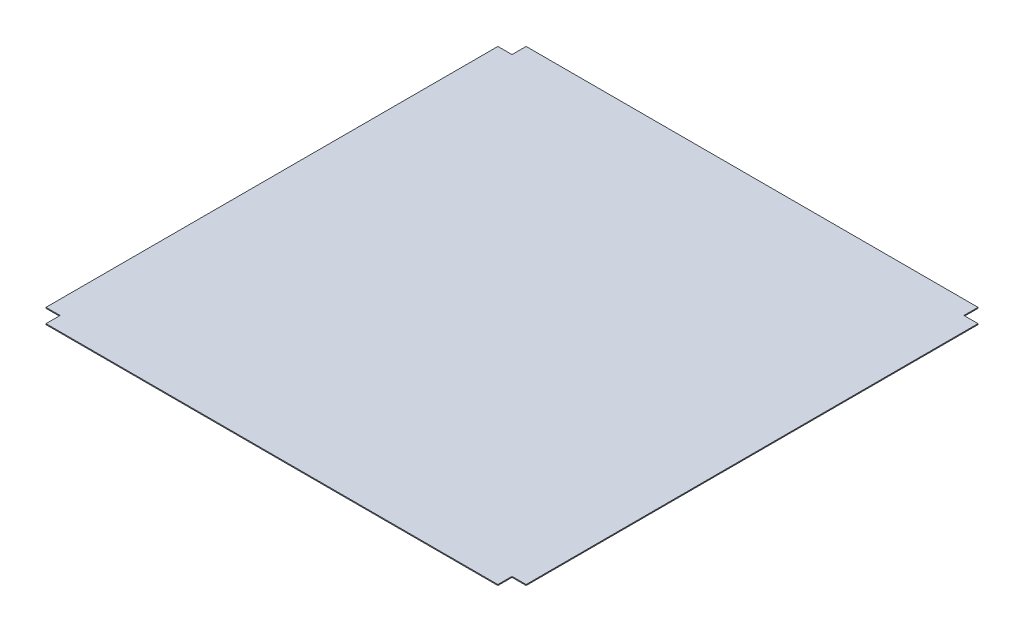
ISO-10303-21;
HEADER;
FILE_DESCRIPTION(('STEP AP214'),'2;1');
FILE_NAME('part.step','',(''),(''),'','','');
FILE_SCHEMA(('AUTOMOTIVE_DESIGN { 1 0 10303 214 1 1 1 1 }'));
ENDSEC;
DATA;
#1=APPLICATION_CONTEXT('core data for automotive mechanical design processes');
#2=APPLICATION_PROTOCOL_DEFINITION('international standard','automotive_design',2000,#1);
#3=PRODUCT_CONTEXT('',#1,'mechanical');
#4=PRODUCT('Part','Part','',(#3));
#5=PRODUCT_RELATED_PRODUCT_CATEGORY('part','',(#4));
#6=PRODUCT_DEFINITION_FORMATION('','',#4);
#7=PRODUCT_DEFINITION_CONTEXT('part definition',#1,'design');
#8=PRODUCT_DEFINITION('design','',#6,#7);
#9=PRODUCT_DEFINITION_SHAPE('','',#8);
#10=(LENGTH_UNIT() NAMED_UNIT(*) SI_UNIT(.MILLI.,.METRE.));
#11=(NAMED_UNIT(*) PLANE_ANGLE_UNIT() SI_UNIT($,.RADIAN.));
#12=(NAMED_UNIT(*) SI_UNIT($,.STERADIAN.) SOLID_ANGLE_UNIT());
#13=UNCERTAINTY_MEASURE_WITH_UNIT(LENGTH_MEASURE(1.E-05),#10,'distance_accuracy_value','');
#14=(GEOMETRIC_REPRESENTATION_CONTEXT(3) GLOBAL_UNCERTAINTY_ASSIGNED_CONTEXT((#13)) GLOBAL_UNIT_ASSIGNED_CONTEXT((#10,
#11,#12)) REPRESENTATION_CONTEXT('',''));
#15=CARTESIAN_POINT('',(0.,0.,0.));
#16=DIRECTION('',(0.,0.,1.));
#17=DIRECTION('',(1.,0.,0.));
#18=AXIS2_PLACEMENT_3D('',#15,#16,#17);
#19=CARTESIAN_POINT('',(-255.,1.,-255.));
#20=DIRECTION('',(1.,0.,0.));
#21=DIRECTION('',(0.,0.,-1.));
#22=AXIS2_PLACEMENT_3D('',#19,#20,#21);
#23=PLANE('',#22);
#24=DIRECTION('',(0.,0.,1.));
#25=VECTOR('',#24,1.);
#26=CARTESIAN_POINT('',(-255.,1.,-255.));
#27=LINE('',#26,#25);
#28=CARTESIAN_POINT('',(-255.,1.,-240.));
#29=VERTEX_POINT('',#28);
#30=CARTESIAN_POINT('',(-255.,1.,240.));
#31=VERTEX_POINT('',#30);
#32=EDGE_CURVE('E137',#29,#31,#27,.T.);
#33=ORIENTED_EDGE('',*,*,#32,.F.);
#34=DIRECTION('',(0.,1.,0.));
#35=VECTOR('',#34,1.);
#36=CARTESIAN_POINT('',(-255.,0.,-240.));
#37=LINE('',#36,#35);
#38=CARTESIAN_POINT('',(-255.,0.,-240.));
#39=VERTEX_POINT('',#38);
#40=EDGE_CURVE('E126',#39,#29,#37,.T.);
#41=ORIENTED_EDGE('',*,*,#40,.F.);
#42=DIRECTION('',(0.,0.,1.));
#43=VECTOR('',#42,1.);
#44=CARTESIAN_POINT('',(-255.,0.,-255.));
#45=LINE('',#44,#43);
#46=CARTESIAN_POINT('',(-255.,0.,240.));
#47=VERTEX_POINT('',#46);
#48=EDGE_CURVE('E136',#39,#47,#45,.T.);
#49=ORIENTED_EDGE('',*,*,#48,.T.);
#50=DIRECTION('',(0.,1.,0.));
#51=VECTOR('',#50,1.);
#52=CARTESIAN_POINT('',(-255.,0.,240.));
#53=LINE('',#52,#51);
#54=EDGE_CURVE('E334',#47,#31,#53,.T.);
#55=ORIENTED_EDGE('',*,*,#54,.T.);
#56=EDGE_LOOP('',(#33,#41,#49,#55));
#57=FACE_BOUND('',#56,.T.);
#58=ADVANCED_FACE('F32',(#57),#23,.F.);
#59=CARTESIAN_POINT('',(-255.,1.,255.));
#60=DIRECTION('',(0.,0.,-1.));
#61=DIRECTION('',(-1.,0.,0.));
#62=AXIS2_PLACEMENT_3D('',#59,#60,#61);
#63=PLANE('',#62);
#64=DIRECTION('',(1.,0.,0.));
#65=VECTOR('',#64,1.);
#66=CARTESIAN_POINT('',(-255.,1.,255.));
#67=LINE('',#66,#65);
#68=CARTESIAN_POINT('',(-240.,1.,255.));
#69=VERTEX_POINT('',#68);
#70=CARTESIAN_POINT('',(240.,1.,255.));
#71=VERTEX_POINT('',#70);
#72=EDGE_CURVE('E159',#69,#71,#67,.T.);
#73=ORIENTED_EDGE('',*,*,#72,.F.);
#74=DIRECTION('',(0.,1.,0.));
#75=VECTOR('',#74,1.);
#76=CARTESIAN_POINT('',(-240.,0.,255.));
#77=LINE('',#76,#75);
#78=CARTESIAN_POINT('',(-240.,0.,255.));
#79=VERTEX_POINT('',#78);
#80=EDGE_CURVE('E339',#79,#69,#77,.T.);
#81=ORIENTED_EDGE('',*,*,#80,.F.);
#82=DIRECTION('',(1.,0.,0.));
#83=VECTOR('',#82,1.);
#84=CARTESIAN_POINT('',(-255.,0.,255.));
#85=LINE('',#84,#83);
#86=CARTESIAN_POINT('',(240.,0.,255.));
#87=VERTEX_POINT('',#86);
#88=EDGE_CURVE('E141',#79,#87,#85,.T.);
#89=ORIENTED_EDGE('',*,*,#88,.T.);
#90=DIRECTION('',(0.,1.,0.));
#91=VECTOR('',#90,1.);
#92=CARTESIAN_POINT('',(240.,0.,255.));
#93=LINE('',#92,#91);
#94=EDGE_CURVE('E315',#87,#71,#93,.T.);
#95=ORIENTED_EDGE('',*,*,#94,.T.);
#96=EDGE_LOOP('',(#73,#81,#89,#95));
#97=FACE_BOUND('',#96,.T.);
#98=ADVANCED_FACE('F190',(#97),#63,.F.);
#99=CARTESIAN_POINT('',(255.,1.,-255.));
#100=DIRECTION('',(-1.,0.,0.));
#101=DIRECTION('',(0.,0.,1.));
#102=AXIS2_PLACEMENT_3D('',#99,#100,#101);
#103=PLANE('',#102);
#104=DIRECTION('',(0.,0.,-1.));
#105=VECTOR('',#104,1.);
#106=CARTESIAN_POINT('',(255.,1.,-255.));
#107=LINE('',#106,#105);
#108=CARTESIAN_POINT('',(255.,1.,240.));
#109=VERTEX_POINT('',#108);
#110=CARTESIAN_POINT('',(255.,1.,-240.));
#111=VERTEX_POINT('',#110);
#112=EDGE_CURVE('E40',#109,#111,#107,.T.);
#113=ORIENTED_EDGE('',*,*,#112,.F.);
#114=DIRECTION('',(0.,1.,0.));
#115=VECTOR('',#114,1.);
#116=CARTESIAN_POINT('',(255.,0.,240.));
#117=LINE('',#116,#115);
#118=CARTESIAN_POINT('',(255.,0.,240.));
#119=VERTEX_POINT('',#118);
#120=EDGE_CURVE('E325',#119,#109,#117,.T.);
#121=ORIENTED_EDGE('',*,*,#120,.F.);
#122=DIRECTION('',(0.,0.,-1.));
#123=VECTOR('',#122,1.);
#124=CARTESIAN_POINT('',(255.,0.,-255.));
#125=LINE('',#124,#123);
#126=CARTESIAN_POINT('',(255.,0.,-240.));
#127=VERTEX_POINT('',#126);
#128=EDGE_CURVE('E144',#119,#127,#125,.T.);
#129=ORIENTED_EDGE('',*,*,#128,.T.);
#130=DIRECTION('',(0.,1.,0.));
#131=VECTOR('',#130,1.);
#132=CARTESIAN_POINT('',(255.,0.,-240.));
#133=LINE('',#132,#131);
#134=EDGE_CURVE('E142',#127,#111,#133,.T.);
#135=ORIENTED_EDGE('',*,*,#134,.T.);
#136=EDGE_LOOP('',(#113,#121,#129,#135));
#137=FACE_BOUND('',#136,.T.);
#138=ADVANCED_FACE('F187',(#137),#103,.F.);
#139=CARTESIAN_POINT('',(-255.,1.,-255.));
#140=DIRECTION('',(0.,0.,1.));
#141=DIRECTION('',(1.,0.,0.));
#142=AXIS2_PLACEMENT_3D('',#139,#140,#141);
#143=PLANE('',#142);
#144=DIRECTION('',(-1.,0.,0.));
#145=VECTOR('',#144,1.);
#146=CARTESIAN_POINT('',(-255.,0.,-255.));
#147=LINE('',#146,#145);
#148=CARTESIAN_POINT('',(240.,0.,-255.));
#149=VERTEX_POINT('',#148);
#150=CARTESIAN_POINT('',(-240.,0.,-255.));
#151=VERTEX_POINT('',#150);
#152=EDGE_CURVE('E35',#149,#151,#147,.T.);
#153=ORIENTED_EDGE('',*,*,#152,.T.);
#154=DIRECTION('',(0.,1.,0.));
#155=VECTOR('',#154,1.);
#156=CARTESIAN_POINT('',(-240.,0.,-255.));
#157=LINE('',#156,#155);
#158=CARTESIAN_POINT('',(-240.,1.,-255.));
#159=VERTEX_POINT('',#158);
#160=EDGE_CURVE('E309',#151,#159,#157,.T.);
#161=ORIENTED_EDGE('',*,*,#160,.T.);
#162=DIRECTION('',(-1.,0.,0.));
#163=VECTOR('',#162,1.);
#164=CARTESIAN_POINT('',(-255.,1.,-255.));
#165=LINE('',#164,#163);
#166=CARTESIAN_POINT('',(240.,1.,-255.));
#167=VERTEX_POINT('',#166);
#168=EDGE_CURVE('E11',#167,#159,#165,.T.);
#169=ORIENTED_EDGE('',*,*,#168,.F.);
#170=DIRECTION('',(0.,1.,0.));
#171=VECTOR('',#170,1.);
#172=CARTESIAN_POINT('',(240.,0.,-255.));
#173=LINE('',#172,#171);
#174=EDGE_CURVE('E166',#149,#167,#173,.T.);
#175=ORIENTED_EDGE('',*,*,#174,.F.);
#176=EDGE_LOOP('',(#153,#161,#169,#175));
#177=FACE_BOUND('',#176,.T.);
#178=ADVANCED_FACE('F189',(#177),#143,.F.);
#179=CARTESIAN_POINT('',(-255.,1.,255.));
#180=DIRECTION('',(0.,1.,0.));
#181=DIRECTION('',(0.,0.,1.));
#182=AXIS2_PLACEMENT_3D('',#179,#180,#181);
#183=PLANE('',#182);
#184=DIRECTION('',(0.,0.,-1.));
#185=VECTOR('',#184,1.);
#186=CARTESIAN_POINT('',(-240.,1.,-255.));
#187=LINE('',#186,#185);
#188=CARTESIAN_POINT('',(-240.,1.,-240.));
#189=VERTEX_POINT('',#188);
#190=EDGE_CURVE('E131',#189,#159,#187,.T.);
#191=ORIENTED_EDGE('',*,*,#190,.F.);
#192=DIRECTION('',(1.,0.,0.));
#193=VECTOR('',#192,1.);
#194=CARTESIAN_POINT('',(-255.,1.,-240.));
#195=LINE('',#194,#193);
#196=EDGE_CURVE('E310',#29,#189,#195,.T.);
#197=ORIENTED_EDGE('',*,*,#196,.F.);
#198=ORIENTED_EDGE('',*,*,#32,.T.);
#199=DIRECTION('',(-1.,0.,0.));
#200=VECTOR('',#199,1.);
#201=CARTESIAN_POINT('',(-255.,1.,240.));
#202=LINE('',#201,#200);
#203=CARTESIAN_POINT('',(-240.,1.,240.));
#204=VERTEX_POINT('',#203);
#205=EDGE_CURVE('E344',#204,#31,#202,.T.);
#206=ORIENTED_EDGE('',*,*,#205,.F.);
#207=DIRECTION('',(0.,0.,-1.));
#208=VECTOR('',#207,1.);
#209=CARTESIAN_POINT('',(-240.,1.,255.));
#210=LINE('',#209,#208);
#211=EDGE_CURVE('E313',#69,#204,#210,.T.);
#212=ORIENTED_EDGE('',*,*,#211,.F.);
#213=ORIENTED_EDGE('',*,*,#72,.T.);
#214=DIRECTION('',(0.,0.,1.));
#215=VECTOR('',#214,1.);
#216=CARTESIAN_POINT('',(240.,1.,255.));
#217=LINE('',#216,#215);
#218=CARTESIAN_POINT('',(240.,1.,240.));
#219=VERTEX_POINT('',#218);
#220=EDGE_CURVE('E329',#219,#71,#217,.T.);
#221=ORIENTED_EDGE('',*,*,#220,.F.);
#222=DIRECTION('',(-1.,0.,0.));
#223=VECTOR('',#222,1.);
#224=CARTESIAN_POINT('',(255.,1.,240.));
#225=LINE('',#224,#223);
#226=EDGE_CURVE('E178',#109,#219,#225,.T.);
#227=ORIENTED_EDGE('',*,*,#226,.F.);
#228=ORIENTED_EDGE('',*,*,#112,.T.);
#229=DIRECTION('',(1.,0.,0.));
#230=VECTOR('',#229,1.);
#231=CARTESIAN_POINT('',(255.,1.,-240.));
#232=LINE('',#231,#230);
#233=CARTESIAN_POINT('',(240.,1.,-240.));
#234=VERTEX_POINT('',#233);
#235=EDGE_CURVE('E175',#234,#111,#232,.T.);
#236=ORIENTED_EDGE('',*,*,#235,.F.);
#237=DIRECTION('',(0.,0.,1.));
#238=VECTOR('',#237,1.);
#239=CARTESIAN_POINT('',(240.,1.,-255.));
#240=LINE('',#239,#238);
#241=EDGE_CURVE('E185',#167,#234,#240,.T.);
#242=ORIENTED_EDGE('',*,*,#241,.F.);
#243=ORIENTED_EDGE('',*,*,#168,.T.);
#244=EDGE_LOOP('',(#191,#197,#198,#206,#212,#213,#221,#227,#228,#236,#242,#243));
#245=FACE_BOUND('',#244,.T.);
#246=ADVANCED_FACE('F173',(#245),#183,.T.);
#247=CARTESIAN_POINT('',(-255.,0.,255.));
#248=DIRECTION('',(0.,1.,0.));
#249=DIRECTION('',(0.,0.,1.));
#250=AXIS2_PLACEMENT_3D('',#247,#248,#249);
#251=PLANE('',#250);
#252=DIRECTION('',(1.,0.,0.));
#253=VECTOR('',#252,1.);
#254=CARTESIAN_POINT('',(-255.,0.,-240.));
#255=LINE('',#254,#253);
#256=CARTESIAN_POINT('',(-240.,0.,-240.));
#257=VERTEX_POINT('',#256);
#258=EDGE_CURVE('E122',#39,#257,#255,.T.);
#259=ORIENTED_EDGE('',*,*,#258,.T.);
#260=DIRECTION('',(0.,0.,-1.));
#261=VECTOR('',#260,1.);
#262=CARTESIAN_POINT('',(-240.,0.,-255.));
#263=LINE('',#262,#261);
#264=EDGE_CURVE('E48',#257,#151,#263,.T.);
#265=ORIENTED_EDGE('',*,*,#264,.T.);
#266=ORIENTED_EDGE('',*,*,#152,.F.);
#267=DIRECTION('',(0.,0.,1.));
#268=VECTOR('',#267,1.);
#269=CARTESIAN_POINT('',(240.,0.,-255.));
#270=LINE('',#269,#268);
#271=CARTESIAN_POINT('',(240.,0.,-240.));
#272=VERTEX_POINT('',#271);
#273=EDGE_CURVE('E184',#149,#272,#270,.T.);
#274=ORIENTED_EDGE('',*,*,#273,.T.);
#275=DIRECTION('',(1.,0.,0.));
#276=VECTOR('',#275,1.);
#277=CARTESIAN_POINT('',(255.,0.,-240.));
#278=LINE('',#277,#276);
#279=EDGE_CURVE('E321',#272,#127,#278,.T.);
#280=ORIENTED_EDGE('',*,*,#279,.T.);
#281=ORIENTED_EDGE('',*,*,#128,.F.);
#282=DIRECTION('',(-1.,0.,0.));
#283=VECTOR('',#282,1.);
#284=CARTESIAN_POINT('',(255.,0.,240.));
#285=LINE('',#284,#283);
#286=CARTESIAN_POINT('',(240.,0.,240.));
#287=VERTEX_POINT('',#286);
#288=EDGE_CURVE('E332',#119,#287,#285,.T.);
#289=ORIENTED_EDGE('',*,*,#288,.T.);
#290=DIRECTION('',(0.,0.,1.));
#291=VECTOR('',#290,1.);
#292=CARTESIAN_POINT('',(240.,0.,255.));
#293=LINE('',#292,#291);
#294=EDGE_CURVE('E327',#287,#87,#293,.T.);
#295=ORIENTED_EDGE('',*,*,#294,.T.);
#296=ORIENTED_EDGE('',*,*,#88,.F.);
#297=DIRECTION('',(0.,0.,-1.));
#298=VECTOR('',#297,1.);
#299=CARTESIAN_POINT('',(-240.,0.,255.));
#300=LINE('',#299,#298);
#301=CARTESIAN_POINT('',(-240.,0.,240.));
#302=VERTEX_POINT('',#301);
#303=EDGE_CURVE('E346',#79,#302,#300,.T.);
#304=ORIENTED_EDGE('',*,*,#303,.T.);
#305=DIRECTION('',(-1.,0.,0.));
#306=VECTOR('',#305,1.);
#307=CARTESIAN_POINT('',(-255.,0.,240.));
#308=LINE('',#307,#306);
#309=EDGE_CURVE('E56',#302,#47,#308,.T.);
#310=ORIENTED_EDGE('',*,*,#309,.T.);
#311=ORIENTED_EDGE('',*,*,#48,.F.);
#312=EDGE_LOOP('',(#259,#265,#266,#274,#280,#281,#289,#295,#296,#304,#310,#311));
#313=FACE_BOUND('',#312,.T.);
#314=ADVANCED_FACE('F139',(#313),#251,.F.);
#315=CARTESIAN_POINT('',(255.,0.,-240.));
#316=DIRECTION('',(0.,0.,1.));
#317=DIRECTION('',(1.,0.,0.));
#318=AXIS2_PLACEMENT_3D('',#315,#316,#317);
#319=PLANE('',#318);
#320=ORIENTED_EDGE('',*,*,#235,.T.);
#321=ORIENTED_EDGE('',*,*,#134,.F.);
#322=ORIENTED_EDGE('',*,*,#279,.F.);
#323=DIRECTION('',(0.,1.,0.));
#324=VECTOR('',#323,1.);
#325=CARTESIAN_POINT('',(240.,0.,-240.));
#326=LINE('',#325,#324);
#327=EDGE_CURVE('E147',#272,#234,#326,.T.);
#328=ORIENTED_EDGE('',*,*,#327,.T.);
#329=EDGE_LOOP('',(#320,#321,#322,#328));
#330=FACE_BOUND('',#329,.T.);
#331=ADVANCED_FACE('F180',(#330),#319,.F.);
#332=CARTESIAN_POINT('',(240.,0.,-255.));
#333=DIRECTION('',(-1.,0.,0.));
#334=DIRECTION('',(0.,0.,1.));
#335=AXIS2_PLACEMENT_3D('',#332,#333,#334);
#336=PLANE('',#335);
#337=ORIENTED_EDGE('',*,*,#241,.T.);
#338=ORIENTED_EDGE('',*,*,#327,.F.);
#339=ORIENTED_EDGE('',*,*,#273,.F.);
#340=ORIENTED_EDGE('',*,*,#174,.T.);
#341=EDGE_LOOP('',(#337,#338,#339,#340));
#342=FACE_BOUND('',#341,.T.);
#343=ADVANCED_FACE('F240',(#342),#336,.F.);
#344=CARTESIAN_POINT('',(240.,0.,255.));
#345=DIRECTION('',(-1.,0.,0.));
#346=DIRECTION('',(0.,0.,1.));
#347=AXIS2_PLACEMENT_3D('',#344,#345,#346);
#348=PLANE('',#347);
#349=ORIENTED_EDGE('',*,*,#220,.T.);
#350=ORIENTED_EDGE('',*,*,#94,.F.);
#351=ORIENTED_EDGE('',*,*,#294,.F.);
#352=DIRECTION('',(0.,1.,0.));
#353=VECTOR('',#352,1.);
#354=CARTESIAN_POINT('',(240.,0.,240.));
#355=LINE('',#354,#353);
#356=EDGE_CURVE('E318',#287,#219,#355,.T.);
#357=ORIENTED_EDGE('',*,*,#356,.T.);
#358=EDGE_LOOP('',(#349,#350,#351,#357));
#359=FACE_BOUND('',#358,.T.);
#360=ADVANCED_FACE('F249',(#359),#348,.F.);
#361=CARTESIAN_POINT('',(255.,0.,240.));
#362=DIRECTION('',(0.,0.,-1.));
#363=DIRECTION('',(-1.,0.,0.));
#364=AXIS2_PLACEMENT_3D('',#361,#362,#363);
#365=PLANE('',#364);
#366=ORIENTED_EDGE('',*,*,#226,.T.);
#367=ORIENTED_EDGE('',*,*,#356,.F.);
#368=ORIENTED_EDGE('',*,*,#288,.F.);
#369=ORIENTED_EDGE('',*,*,#120,.T.);
#370=EDGE_LOOP('',(#366,#367,#368,#369));
#371=FACE_BOUND('',#370,.T.);
#372=ADVANCED_FACE('F259',(#371),#365,.F.);
#373=CARTESIAN_POINT('',(-255.,0.,240.));
#374=DIRECTION('',(0.,0.,-1.));
#375=DIRECTION('',(-1.,0.,0.));
#376=AXIS2_PLACEMENT_3D('',#373,#374,#375);
#377=PLANE('',#376);
#378=ORIENTED_EDGE('',*,*,#205,.T.);
#379=ORIENTED_EDGE('',*,*,#54,.F.);
#380=ORIENTED_EDGE('',*,*,#309,.F.);
#381=DIRECTION('',(0.,1.,0.));
#382=VECTOR('',#381,1.);
#383=CARTESIAN_POINT('',(-240.,0.,240.));
#384=LINE('',#383,#382);
#385=EDGE_CURVE('E341',#302,#204,#384,.T.);
#386=ORIENTED_EDGE('',*,*,#385,.T.);
#387=EDGE_LOOP('',(#378,#379,#380,#386));
#388=FACE_BOUND('',#387,.T.);
#389=ADVANCED_FACE('F269',(#388),#377,.F.);
#390=CARTESIAN_POINT('',(-240.,0.,255.));
#391=DIRECTION('',(1.,0.,0.));
#392=DIRECTION('',(0.,0.,-1.));
#393=AXIS2_PLACEMENT_3D('',#390,#391,#392);
#394=PLANE('',#393);
#395=ORIENTED_EDGE('',*,*,#211,.T.);
#396=ORIENTED_EDGE('',*,*,#385,.F.);
#397=ORIENTED_EDGE('',*,*,#303,.F.);
#398=ORIENTED_EDGE('',*,*,#80,.T.);
#399=EDGE_LOOP('',(#395,#396,#397,#398));
#400=FACE_BOUND('',#399,.T.);
#401=ADVANCED_FACE('F279',(#400),#394,.F.);
#402=CARTESIAN_POINT('',(-240.,0.,-255.));
#403=DIRECTION('',(1.,0.,0.));
#404=DIRECTION('',(0.,0.,-1.));
#405=AXIS2_PLACEMENT_3D('',#402,#403,#404);
#406=PLANE('',#405);
#407=ORIENTED_EDGE('',*,*,#190,.T.);
#408=ORIENTED_EDGE('',*,*,#160,.F.);
#409=ORIENTED_EDGE('',*,*,#264,.F.);
#410=DIRECTION('',(0.,1.,0.));
#411=VECTOR('',#410,1.);
#412=CARTESIAN_POINT('',(-240.,0.,-240.));
#413=LINE('',#412,#411);
#414=EDGE_CURVE('E128',#257,#189,#413,.T.);
#415=ORIENTED_EDGE('',*,*,#414,.T.);
#416=EDGE_LOOP('',(#407,#408,#409,#415));
#417=FACE_BOUND('',#416,.T.);
#418=ADVANCED_FACE('F288',(#417),#406,.F.);
#419=CARTESIAN_POINT('',(-255.,0.,-240.));
#420=DIRECTION('',(0.,0.,1.));
#421=DIRECTION('',(1.,0.,0.));
#422=AXIS2_PLACEMENT_3D('',#419,#420,#421);
#423=PLANE('',#422);
#424=ORIENTED_EDGE('',*,*,#196,.T.);
#425=ORIENTED_EDGE('',*,*,#414,.F.);
#426=ORIENTED_EDGE('',*,*,#258,.F.);
#427=ORIENTED_EDGE('',*,*,#40,.T.);
#428=EDGE_LOOP('',(#424,#425,#426,#427));
#429=FACE_BOUND('',#428,.T.);
#430=ADVANCED_FACE('F125',(#429),#423,.F.);
#431=CLOSED_SHELL('',(#58,#98,#138,#178,#246,#314,#331,#343,#360,#372,#389,#401,#418,#430));
#432=MANIFOLD_SOLID_BREP('B2',#431);
#433=ADVANCED_BREP_SHAPE_REPRESENTATION('',(#18,#432),#14);
#434=SHAPE_DEFINITION_REPRESENTATION(#9,#433);
ENDSEC;
END-ISO-10303-21;
